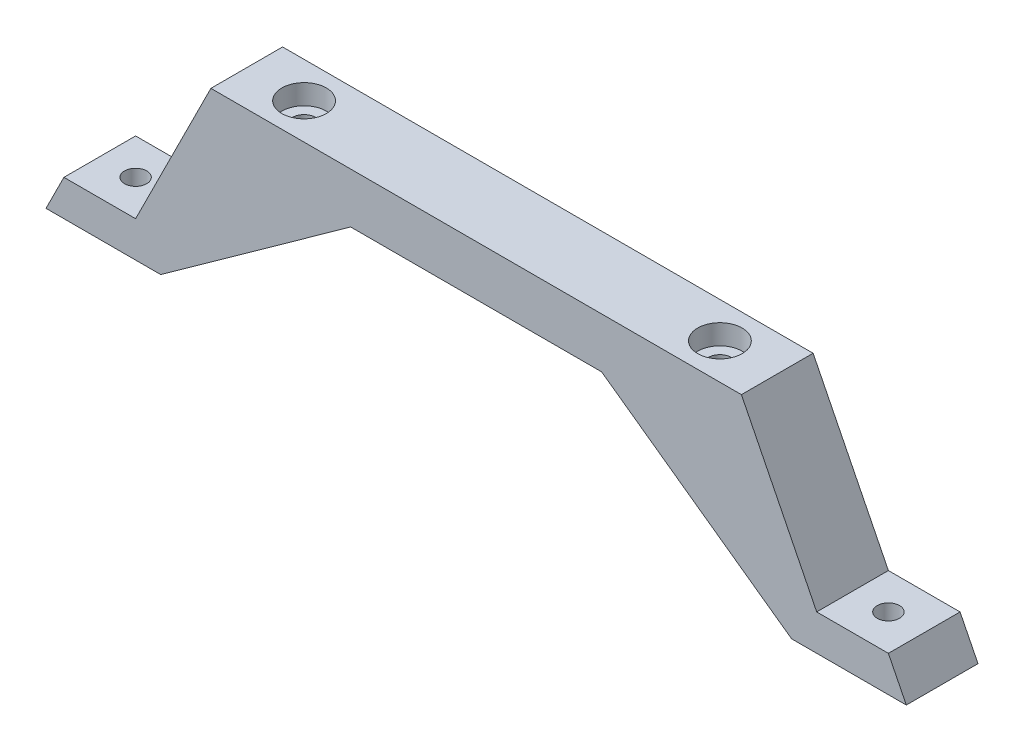
ISO-10303-21;
HEADER;
FILE_DESCRIPTION(('STEP AP214'),'2;1');
FILE_NAME('part.step','',(''),(''),'','','');
FILE_SCHEMA(('AUTOMOTIVE_DESIGN { 1 0 10303 214 1 1 1 1 }'));
ENDSEC;
DATA;
#1=APPLICATION_CONTEXT('core data for automotive mechanical design processes');
#2=APPLICATION_PROTOCOL_DEFINITION('international standard','automotive_design',2000,#1);
#3=PRODUCT_CONTEXT('',#1,'mechanical');
#4=PRODUCT('Part','Part','',(#3));
#5=PRODUCT_RELATED_PRODUCT_CATEGORY('part','',(#4));
#6=PRODUCT_DEFINITION_FORMATION('','',#4);
#7=PRODUCT_DEFINITION_CONTEXT('part definition',#1,'design');
#8=PRODUCT_DEFINITION('design','',#6,#7);
#9=PRODUCT_DEFINITION_SHAPE('','',#8);
#10=(LENGTH_UNIT() NAMED_UNIT(*) SI_UNIT(.MILLI.,.METRE.));
#11=(NAMED_UNIT(*) PLANE_ANGLE_UNIT() SI_UNIT($,.RADIAN.));
#12=(NAMED_UNIT(*) SI_UNIT($,.STERADIAN.) SOLID_ANGLE_UNIT());
#13=UNCERTAINTY_MEASURE_WITH_UNIT(LENGTH_MEASURE(1.E-05),#10,'distance_accuracy_value','');
#14=(GEOMETRIC_REPRESENTATION_CONTEXT(3) GLOBAL_UNCERTAINTY_ASSIGNED_CONTEXT((#13)) GLOBAL_UNIT_ASSIGNED_CONTEXT((#10,
#11,#12)) REPRESENTATION_CONTEXT('',''));
#15=CARTESIAN_POINT('',(0.,0.,0.));
#16=DIRECTION('',(0.,0.,1.));
#17=DIRECTION('',(1.,0.,0.));
#18=AXIS2_PLACEMENT_3D('',#15,#16,#17);
#19=CARTESIAN_POINT('',(62.8112870760149,-12.9471515277979,5.));
#20=DIRECTION('',(0.,1.,0.));
#21=DIRECTION('',(0.,0.,1.));
#22=AXIS2_PLACEMENT_3D('',#19,#20,#21);
#23=CYLINDRICAL_SURFACE('',#22,1.60000000000001);
#24=CARTESIAN_POINT('',(62.8112870760149,-2.19243454666585,5.));
#25=DIRECTION('',(-0.582687773294949,-0.812696104858744,0.));
#26=DIRECTION('',(-0.812696104858744,0.582687773294949,0.));
#27=AXIS2_PLACEMENT_3D('',#24,#25,#26);
#28=ELLIPSE('',#27,1.96875559072367,1.60000000000001);
#29=CARTESIAN_POINT('',(61.2112870760149,-1.0452647353451,5.));
#30=VERTEX_POINT('',#29);
#31=EDGE_CURVE('E150',#30,#30,#28,.T.);
#32=ORIENTED_EDGE('',*,*,#31,.T.);
#33=EDGE_LOOP('',(#32));
#34=FACE_BOUND('',#33,.T.);
#35=CARTESIAN_POINT('',(62.8112870760149,10.2528484722021,5.));
#36=DIRECTION('',(0.,1.,0.));
#37=DIRECTION('',(0.,0.,1.));
#38=AXIS2_PLACEMENT_3D('',#35,#36,#37);
#39=CIRCLE('',#38,1.60000000000001);
#40=CARTESIAN_POINT('',(62.8112870760149,10.2528484722021,6.6));
#41=VERTEX_POINT('',#40);
#42=EDGE_CURVE('E38',#41,#41,#39,.F.);
#43=ORIENTED_EDGE('',*,*,#42,.F.);
#44=EDGE_LOOP('',(#43));
#45=FACE_BOUND('',#44,.T.);
#46=ADVANCED_FACE('F34',(#34,#45),#23,.F.);
#47=CARTESIAN_POINT('',(4.8112870760149,-12.9471515277979,5.));
#48=DIRECTION('',(0.,1.,0.));
#49=DIRECTION('',(0.,0.,1.));
#50=AXIS2_PLACEMENT_3D('',#47,#48,#49);
#51=CYLINDRICAL_SURFACE('',#50,1.6);
#52=CARTESIAN_POINT('',(4.8112870760149,-2.19243454666585,5.));
#53=DIRECTION('',(-0.582687773294949,0.812696104858744,0.));
#54=DIRECTION('',(0.812696104858744,0.582687773294949,0.));
#55=AXIS2_PLACEMENT_3D('',#52,#53,#54);
#56=ELLIPSE('',#55,1.96875559072367,1.6);
#57=CARTESIAN_POINT('',(6.4112870760149,-1.0452647353451,5.));
#58=VERTEX_POINT('',#57);
#59=EDGE_CURVE('E152',#58,#58,#56,.T.);
#60=ORIENTED_EDGE('',*,*,#59,.F.);
#61=EDGE_LOOP('',(#60));
#62=FACE_BOUND('',#61,.T.);
#63=CARTESIAN_POINT('',(4.8112870760149,10.2528484722021,5.));
#64=DIRECTION('',(0.,1.,0.));
#65=DIRECTION('',(0.,0.,1.));
#66=AXIS2_PLACEMENT_3D('',#63,#64,#65);
#67=CIRCLE('',#66,1.6);
#68=CARTESIAN_POINT('',(4.8112870760149,10.2528484722021,6.6));
#69=VERTEX_POINT('',#68);
#70=EDGE_CURVE('E153',#69,#69,#67,.F.);
#71=ORIENTED_EDGE('',*,*,#70,.F.);
#72=EDGE_LOOP('',(#71));
#73=FACE_BOUND('',#72,.T.);
#74=ADVANCED_FACE('F287',(#62,#73),#51,.F.);
#75=CARTESIAN_POINT('',(-23.6887129239851,-7.94715152779793,10.));
#76=DIRECTION('',(0.894427190999916,-0.447213595499958,0.));
#77=DIRECTION('',(0.447213595499958,0.894427190999916,0.));
#78=AXIS2_PLACEMENT_3D('',#75,#76,#77);
#79=PLANE('',#78);
#80=DIRECTION('',(-0.447213595499958,-0.894427190999916,0.));
#81=VECTOR('',#80,1.);
#82=CARTESIAN_POINT('',(-23.6887129239851,-7.94715152779793,0.));
#83=LINE('',#82,#81);
#84=CARTESIAN_POINT('',(-23.6887129239851,-7.94715152779793,0.));
#85=VERTEX_POINT('',#84);
#86=CARTESIAN_POINT('',(-26.1887129239851,-12.9471515277979,0.));
#87=VERTEX_POINT('',#86);
#88=EDGE_CURVE('E129',#85,#87,#83,.T.);
#89=ORIENTED_EDGE('',*,*,#88,.T.);
#90=DIRECTION('',(0.,0.,-1.));
#91=VECTOR('',#90,1.);
#92=CARTESIAN_POINT('',(-26.1887129239851,-12.9471515277979,10.));
#93=LINE('',#92,#91);
#94=CARTESIAN_POINT('',(-26.1887129239851,-12.9471515277979,10.));
#95=VERTEX_POINT('',#94);
#96=EDGE_CURVE('E11',#95,#87,#93,.T.);
#97=ORIENTED_EDGE('',*,*,#96,.F.);
#98=DIRECTION('',(-0.447213595499958,-0.894427190999916,0.));
#99=VECTOR('',#98,1.);
#100=CARTESIAN_POINT('',(-23.6887129239851,-7.94715152779793,10.));
#101=LINE('',#100,#99);
#102=CARTESIAN_POINT('',(-23.6887129239851,-7.94715152779793,10.));
#103=VERTEX_POINT('',#102);
#104=EDGE_CURVE('E143',#103,#95,#101,.T.);
#105=ORIENTED_EDGE('',*,*,#104,.F.);
#106=DIRECTION('',(0.,0.,-1.));
#107=VECTOR('',#106,1.);
#108=CARTESIAN_POINT('',(-23.6887129239851,-7.94715152779793,10.));
#109=LINE('',#108,#107);
#110=EDGE_CURVE('E125',#103,#85,#109,.T.);
#111=ORIENTED_EDGE('',*,*,#110,.T.);
#112=EDGE_LOOP('',(#89,#97,#105,#111));
#113=FACE_BOUND('',#112,.T.);
#114=ADVANCED_FACE('F36',(#113),#79,.F.);
#115=CARTESIAN_POINT('',(-26.1887129239851,-12.9471515277979,10.));
#116=DIRECTION('',(0.,1.,0.));
#117=DIRECTION('',(0.,0.,1.));
#118=AXIS2_PLACEMENT_3D('',#115,#116,#117);
#119=PLANE('',#118);
#120=CARTESIAN_POINT('',(-18.6887129239851,-12.9471515277979,5.));
#121=DIRECTION('',(0.,1.,0.));
#122=DIRECTION('',(0.,0.,1.));
#123=AXIS2_PLACEMENT_3D('',#120,#121,#122);
#124=CIRCLE('',#123,1.55);
#125=CARTESIAN_POINT('',(-18.6887129239851,-12.9471515277979,6.55));
#126=VERTEX_POINT('',#125);
#127=EDGE_CURVE('E490',#126,#126,#124,.T.);
#128=ORIENTED_EDGE('',*,*,#127,.T.);
#129=EDGE_LOOP('',(#128));
#130=FACE_BOUND('',#129,.T.);
#131=DIRECTION('',(1.,0.,0.));
#132=VECTOR('',#131,1.);
#133=CARTESIAN_POINT('',(-26.1887129239851,-12.9471515277979,0.));
#134=LINE('',#133,#132);
#135=CARTESIAN_POINT('',(-10.1887129239851,-12.9471515277979,0.));
#136=VERTEX_POINT('',#135);
#137=EDGE_CURVE('E132',#87,#136,#134,.T.);
#138=ORIENTED_EDGE('',*,*,#137,.T.);
#139=DIRECTION('',(0.,0.,-1.));
#140=VECTOR('',#139,1.);
#141=CARTESIAN_POINT('',(-10.1887129239851,-12.9471515277979,10.));
#142=LINE('',#141,#140);
#143=CARTESIAN_POINT('',(-10.1887129239851,-12.9471515277979,10.));
#144=VERTEX_POINT('',#143);
#145=EDGE_CURVE('E44',#144,#136,#142,.T.);
#146=ORIENTED_EDGE('',*,*,#145,.F.);
#147=DIRECTION('',(1.,0.,0.));
#148=VECTOR('',#147,1.);
#149=CARTESIAN_POINT('',(-26.1887129239851,-12.9471515277979,10.));
#150=LINE('',#149,#148);
#151=EDGE_CURVE('E91',#95,#144,#150,.T.);
#152=ORIENTED_EDGE('',*,*,#151,.F.);
#153=ORIENTED_EDGE('',*,*,#96,.T.);
#154=EDGE_LOOP('',(#138,#146,#152,#153));
#155=FACE_BOUND('',#154,.T.);
#156=ADVANCED_FACE('F464',(#130,#155),#119,.F.);
#157=CARTESIAN_POINT('',(-10.1887129239851,-12.9471515277979,10.));
#158=DIRECTION('',(-0.582687773294949,0.812696104858744,0.));
#159=DIRECTION('',(-0.812696104858744,-0.582687773294949,0.));
#160=AXIS2_PLACEMENT_3D('',#157,#158,#159);
#161=PLANE('',#160);
#162=ORIENTED_EDGE('',*,*,#59,.T.);
#163=EDGE_LOOP('',(#162));
#164=FACE_BOUND('',#163,.T.);
#165=DIRECTION('',(0.812696104858744,0.582687773294949,0.));
#166=VECTOR('',#165,1.);
#167=CARTESIAN_POINT('',(-10.1887129239851,-12.9471515277979,0.));
#168=LINE('',#167,#166);
#169=CARTESIAN_POINT('',(16.3112870760149,6.05284847220206,0.));
#170=VERTEX_POINT('',#169);
#171=EDGE_CURVE('E135',#136,#170,#168,.T.);
#172=ORIENTED_EDGE('',*,*,#171,.T.);
#173=DIRECTION('',(0.,0.,-1.));
#174=VECTOR('',#173,1.);
#175=CARTESIAN_POINT('',(16.3112870760149,6.05284847220206,10.));
#176=LINE('',#175,#174);
#177=CARTESIAN_POINT('',(16.3112870760149,6.05284847220206,10.));
#178=VERTEX_POINT('',#177);
#179=EDGE_CURVE('E120',#178,#170,#176,.T.);
#180=ORIENTED_EDGE('',*,*,#179,.F.);
#181=DIRECTION('',(0.812696104858744,0.582687773294949,0.));
#182=VECTOR('',#181,1.);
#183=CARTESIAN_POINT('',(-10.1887129239851,-12.9471515277979,10.));
#184=LINE('',#183,#182);
#185=EDGE_CURVE('E217',#144,#178,#184,.T.);
#186=ORIENTED_EDGE('',*,*,#185,.F.);
#187=ORIENTED_EDGE('',*,*,#145,.T.);
#188=EDGE_LOOP('',(#172,#180,#186,#187));
#189=FACE_BOUND('',#188,.T.);
#190=ADVANCED_FACE('F447',(#164,#189),#161,.F.);
#191=CARTESIAN_POINT('',(16.3112870760149,6.05284847220206,10.));
#192=DIRECTION('',(0.,1.,0.));
#193=DIRECTION('',(-1.,0.,0.));
#194=AXIS2_PLACEMENT_3D('',#191,#192,#193);
#195=PLANE('',#194);
#196=DIRECTION('',(1.,0.,0.));
#197=VECTOR('',#196,1.);
#198=CARTESIAN_POINT('',(16.3112870760149,6.05284847220206,0.));
#199=LINE('',#198,#197);
#200=CARTESIAN_POINT('',(51.3112870760149,6.05284847220206,0.));
#201=VERTEX_POINT('',#200);
#202=EDGE_CURVE('E137',#170,#201,#199,.T.);
#203=ORIENTED_EDGE('',*,*,#202,.T.);
#204=DIRECTION('',(0.,0.,-1.));
#205=VECTOR('',#204,1.);
#206=CARTESIAN_POINT('',(51.3112870760149,6.05284847220206,10.));
#207=LINE('',#206,#205);
#208=CARTESIAN_POINT('',(51.3112870760149,6.05284847220206,10.));
#209=VERTEX_POINT('',#208);
#210=EDGE_CURVE('E205',#209,#201,#207,.T.);
#211=ORIENTED_EDGE('',*,*,#210,.F.);
#212=DIRECTION('',(1.,0.,0.));
#213=VECTOR('',#212,1.);
#214=CARTESIAN_POINT('',(16.3112870760149,6.05284847220206,10.));
#215=LINE('',#214,#213);
#216=EDGE_CURVE('E114',#178,#209,#215,.T.);
#217=ORIENTED_EDGE('',*,*,#216,.F.);
#218=ORIENTED_EDGE('',*,*,#179,.T.);
#219=EDGE_LOOP('',(#203,#211,#217,#218));
#220=FACE_BOUND('',#219,.T.);
#221=ADVANCED_FACE('F229',(#220),#195,.F.);
#222=CARTESIAN_POINT('',(-3.1887129239851,13.0528484722021,10.));
#223=DIRECTION('',(0.,-1.,0.));
#224=DIRECTION('',(0.,0.,-1.));
#225=AXIS2_PLACEMENT_3D('',#222,#223,#224);
#226=PLANE('',#225);
#227=CARTESIAN_POINT('',(62.8112870760149,13.0528484722021,5.));
#228=DIRECTION('',(0.,1.,0.));
#229=DIRECTION('',(0.,0.,1.));
#230=AXIS2_PLACEMENT_3D('',#227,#228,#229);
#231=CIRCLE('',#230,3.1);
#232=CARTESIAN_POINT('',(62.8112870760149,13.0528484722021,8.1));
#233=VERTEX_POINT('',#232);
#234=EDGE_CURVE('E166',#233,#233,#231,.T.);
#235=ORIENTED_EDGE('',*,*,#234,.F.);
#236=EDGE_LOOP('',(#235));
#237=FACE_BOUND('',#236,.T.);
#238=CARTESIAN_POINT('',(4.8112870760149,13.0528484722021,5.));
#239=DIRECTION('',(0.,1.,0.));
#240=DIRECTION('',(0.,0.,1.));
#241=AXIS2_PLACEMENT_3D('',#238,#239,#240);
#242=CIRCLE('',#241,3.1);
#243=CARTESIAN_POINT('',(4.8112870760149,13.0528484722021,8.1));
#244=VERTEX_POINT('',#243);
#245=EDGE_CURVE('E159',#244,#244,#242,.T.);
#246=ORIENTED_EDGE('',*,*,#245,.F.);
#247=EDGE_LOOP('',(#246));
#248=FACE_BOUND('',#247,.T.);
#249=DIRECTION('',(-1.,0.,0.));
#250=VECTOR('',#249,1.);
#251=CARTESIAN_POINT('',(-3.1887129239851,13.0528484722021,0.));
#252=LINE('',#251,#250);
#253=CARTESIAN_POINT('',(70.8112870760149,13.0528484722021,0.));
#254=VERTEX_POINT('',#253);
#255=CARTESIAN_POINT('',(-3.1887129239851,13.0528484722021,0.));
#256=VERTEX_POINT('',#255);
#257=EDGE_CURVE('E119',#254,#256,#252,.T.);
#258=ORIENTED_EDGE('',*,*,#257,.T.);
#259=DIRECTION('',(0.,0.,-1.));
#260=VECTOR('',#259,1.);
#261=CARTESIAN_POINT('',(-3.1887129239851,13.0528484722021,10.));
#262=LINE('',#261,#260);
#263=CARTESIAN_POINT('',(-3.1887129239851,13.0528484722021,10.));
#264=VERTEX_POINT('',#263);
#265=EDGE_CURVE('E116',#264,#256,#262,.T.);
#266=ORIENTED_EDGE('',*,*,#265,.F.);
#267=DIRECTION('',(-1.,0.,0.));
#268=VECTOR('',#267,1.);
#269=CARTESIAN_POINT('',(-3.1887129239851,13.0528484722021,10.));
#270=LINE('',#269,#268);
#271=CARTESIAN_POINT('',(70.8112870760149,13.0528484722021,10.));
#272=VERTEX_POINT('',#271);
#273=EDGE_CURVE('E102',#272,#264,#270,.T.);
#274=ORIENTED_EDGE('',*,*,#273,.F.);
#275=DIRECTION('',(0.,0.,-1.));
#276=VECTOR('',#275,1.);
#277=CARTESIAN_POINT('',(70.8112870760149,13.0528484722021,10.));
#278=LINE('',#277,#276);
#279=EDGE_CURVE('E208',#272,#254,#278,.T.);
#280=ORIENTED_EDGE('',*,*,#279,.T.);
#281=EDGE_LOOP('',(#258,#266,#274,#280));
#282=FACE_BOUND('',#281,.T.);
#283=ADVANCED_FACE('F117',(#237,#248,#282),#226,.F.);
#284=CARTESIAN_POINT('',(-13.6887129239851,-7.94715152779793,10.));
#285=DIRECTION('',(0.894427190999916,-0.447213595499958,0.));
#286=DIRECTION('',(0.447213595499958,0.894427190999916,0.));
#287=AXIS2_PLACEMENT_3D('',#284,#285,#286);
#288=PLANE('',#287);
#289=DIRECTION('',(-0.447213595499958,-0.894427190999916,0.));
#290=VECTOR('',#289,1.);
#291=CARTESIAN_POINT('',(-13.6887129239851,-7.94715152779793,0.));
#292=LINE('',#291,#290);
#293=CARTESIAN_POINT('',(-13.6887129239851,-7.94715152779793,0.));
#294=VERTEX_POINT('',#293);
#295=EDGE_CURVE('E77',#256,#294,#292,.T.);
#296=ORIENTED_EDGE('',*,*,#295,.T.);
#297=DIRECTION('',(0.,0.,-1.));
#298=VECTOR('',#297,1.);
#299=CARTESIAN_POINT('',(-13.6887129239851,-7.94715152779793,10.));
#300=LINE('',#299,#298);
#301=CARTESIAN_POINT('',(-13.6887129239851,-7.94715152779793,10.));
#302=VERTEX_POINT('',#301);
#303=EDGE_CURVE('E121',#302,#294,#300,.T.);
#304=ORIENTED_EDGE('',*,*,#303,.F.);
#305=DIRECTION('',(-0.447213595499958,-0.894427190999916,0.));
#306=VECTOR('',#305,1.);
#307=CARTESIAN_POINT('',(-13.6887129239851,-7.94715152779793,10.));
#308=LINE('',#307,#306);
#309=EDGE_CURVE('E106',#264,#302,#308,.T.);
#310=ORIENTED_EDGE('',*,*,#309,.F.);
#311=ORIENTED_EDGE('',*,*,#265,.T.);
#312=EDGE_LOOP('',(#296,#304,#310,#311));
#313=FACE_BOUND('',#312,.T.);
#314=ADVANCED_FACE('F123',(#313),#288,.F.);
#315=CARTESIAN_POINT('',(-13.6887129239851,-7.94715152779793,10.));
#316=DIRECTION('',(0.,-1.,0.));
#317=DIRECTION('',(0.,0.,-1.));
#318=AXIS2_PLACEMENT_3D('',#315,#316,#317);
#319=PLANE('',#318);
#320=CARTESIAN_POINT('',(-18.6887129239851,-7.94715152779793,5.));
#321=DIRECTION('',(0.,1.,0.));
#322=DIRECTION('',(0.,0.,1.));
#323=AXIS2_PLACEMENT_3D('',#320,#321,#322);
#324=CIRCLE('',#323,1.55);
#325=CARTESIAN_POINT('',(-18.6887129239851,-7.94715152779793,6.55));
#326=VERTEX_POINT('',#325);
#327=EDGE_CURVE('E491',#326,#326,#324,.T.);
#328=ORIENTED_EDGE('',*,*,#327,.F.);
#329=EDGE_LOOP('',(#328));
#330=FACE_BOUND('',#329,.T.);
#331=DIRECTION('',(-1.,0.,0.));
#332=VECTOR('',#331,1.);
#333=CARTESIAN_POINT('',(-13.6887129239851,-7.94715152779793,0.));
#334=LINE('',#333,#332);
#335=EDGE_CURVE('E83',#294,#85,#334,.T.);
#336=ORIENTED_EDGE('',*,*,#335,.T.);
#337=ORIENTED_EDGE('',*,*,#110,.F.);
#338=DIRECTION('',(-1.,0.,0.));
#339=VECTOR('',#338,1.);
#340=CARTESIAN_POINT('',(-13.6887129239851,-7.94715152779793,10.));
#341=LINE('',#340,#339);
#342=EDGE_CURVE('E53',#302,#103,#341,.T.);
#343=ORIENTED_EDGE('',*,*,#342,.F.);
#344=ORIENTED_EDGE('',*,*,#303,.T.);
#345=EDGE_LOOP('',(#336,#337,#343,#344));
#346=FACE_BOUND('',#345,.T.);
#347=ADVANCED_FACE('F274',(#330,#346),#319,.F.);
#348=CARTESIAN_POINT('',(0.,0.,10.));
#349=DIRECTION('',(0.,0.,1.));
#350=DIRECTION('',(1.,0.,0.));
#351=AXIS2_PLACEMENT_3D('',#348,#349,#350);
#352=PLANE('',#351);
#353=ORIENTED_EDGE('',*,*,#104,.T.);
#354=ORIENTED_EDGE('',*,*,#151,.T.);
#355=ORIENTED_EDGE('',*,*,#185,.T.);
#356=ORIENTED_EDGE('',*,*,#216,.T.);
#357=DIRECTION('',(-0.812696104858744,0.582687773294949,0.));
#358=VECTOR('',#357,1.);
#359=CARTESIAN_POINT('',(77.8112870760149,-12.9471515277979,10.));
#360=LINE('',#359,#358);
#361=CARTESIAN_POINT('',(77.8112870760149,-12.9471515277979,10.));
#362=VERTEX_POINT('',#361);
#363=EDGE_CURVE('E180',#362,#209,#360,.T.);
#364=ORIENTED_EDGE('',*,*,#363,.F.);
#365=DIRECTION('',(-1.,0.,0.));
#366=VECTOR('',#365,1.);
#367=CARTESIAN_POINT('',(93.8112870760149,-12.9471515277979,10.));
#368=LINE('',#367,#366);
#369=CARTESIAN_POINT('',(93.8112870760149,-12.9471515277979,10.));
#370=VERTEX_POINT('',#369);
#371=EDGE_CURVE('E183',#370,#362,#368,.T.);
#372=ORIENTED_EDGE('',*,*,#371,.F.);
#373=DIRECTION('',(0.447213595499958,-0.894427190999916,0.));
#374=VECTOR('',#373,1.);
#375=CARTESIAN_POINT('',(91.3112870760149,-7.94715152779793,10.));
#376=LINE('',#375,#374);
#377=CARTESIAN_POINT('',(91.3112870760149,-7.94715152779793,10.));
#378=VERTEX_POINT('',#377);
#379=EDGE_CURVE('E172',#378,#370,#376,.T.);
#380=ORIENTED_EDGE('',*,*,#379,.F.);
#381=DIRECTION('',(1.,0.,0.));
#382=VECTOR('',#381,1.);
#383=CARTESIAN_POINT('',(81.3112870760149,-7.94715152779793,10.));
#384=LINE('',#383,#382);
#385=CARTESIAN_POINT('',(81.3112870760149,-7.94715152779793,10.));
#386=VERTEX_POINT('',#385);
#387=EDGE_CURVE('E175',#386,#378,#384,.T.);
#388=ORIENTED_EDGE('',*,*,#387,.F.);
#389=DIRECTION('',(0.447213595499958,-0.894427190999916,0.));
#390=VECTOR('',#389,1.);
#391=CARTESIAN_POINT('',(81.3112870760149,-7.94715152779793,10.));
#392=LINE('',#391,#390);
#393=EDGE_CURVE('E110',#272,#386,#392,.T.);
#394=ORIENTED_EDGE('',*,*,#393,.F.);
#395=ORIENTED_EDGE('',*,*,#273,.T.);
#396=ORIENTED_EDGE('',*,*,#309,.T.);
#397=ORIENTED_EDGE('',*,*,#342,.T.);
#398=EDGE_LOOP('',(#353,#354,#355,#356,#364,#372,#380,#388,#394,#395,#396,#397));
#399=FACE_BOUND('',#398,.T.);
#400=ADVANCED_FACE('F104',(#399),#352,.T.);
#401=CARTESIAN_POINT('',(0.,0.,0.));
#402=DIRECTION('',(0.,0.,1.));
#403=DIRECTION('',(1.,0.,0.));
#404=AXIS2_PLACEMENT_3D('',#401,#402,#403);
#405=PLANE('',#404);
#406=ORIENTED_EDGE('',*,*,#88,.F.);
#407=ORIENTED_EDGE('',*,*,#335,.F.);
#408=ORIENTED_EDGE('',*,*,#295,.F.);
#409=ORIENTED_EDGE('',*,*,#257,.F.);
#410=DIRECTION('',(0.447213595499958,-0.894427190999916,0.));
#411=VECTOR('',#410,1.);
#412=CARTESIAN_POINT('',(81.3112870760149,-7.94715152779793,0.));
#413=LINE('',#412,#411);
#414=CARTESIAN_POINT('',(81.3112870760149,-7.94715152779793,0.));
#415=VERTEX_POINT('',#414);
#416=EDGE_CURVE('E192',#254,#415,#413,.T.);
#417=ORIENTED_EDGE('',*,*,#416,.T.);
#418=DIRECTION('',(1.,0.,0.));
#419=VECTOR('',#418,1.);
#420=CARTESIAN_POINT('',(81.3112870760149,-7.94715152779793,0.));
#421=LINE('',#420,#419);
#422=CARTESIAN_POINT('',(91.3112870760149,-7.94715152779793,0.));
#423=VERTEX_POINT('',#422);
#424=EDGE_CURVE('E189',#415,#423,#421,.T.);
#425=ORIENTED_EDGE('',*,*,#424,.T.);
#426=DIRECTION('',(0.447213595499958,-0.894427190999916,0.));
#427=VECTOR('',#426,1.);
#428=CARTESIAN_POINT('',(91.3112870760149,-7.94715152779793,0.));
#429=LINE('',#428,#427);
#430=CARTESIAN_POINT('',(93.8112870760149,-12.9471515277979,0.));
#431=VERTEX_POINT('',#430);
#432=EDGE_CURVE('E171',#423,#431,#429,.T.);
#433=ORIENTED_EDGE('',*,*,#432,.T.);
#434=DIRECTION('',(-1.,0.,0.));
#435=VECTOR('',#434,1.);
#436=CARTESIAN_POINT('',(93.8112870760149,-12.9471515277979,0.));
#437=LINE('',#436,#435);
#438=CARTESIAN_POINT('',(77.8112870760149,-12.9471515277979,0.));
#439=VERTEX_POINT('',#438);
#440=EDGE_CURVE('E176',#431,#439,#437,.T.);
#441=ORIENTED_EDGE('',*,*,#440,.T.);
#442=DIRECTION('',(-0.812696104858744,0.582687773294949,0.));
#443=VECTOR('',#442,1.);
#444=CARTESIAN_POINT('',(77.8112870760149,-12.9471515277979,0.));
#445=LINE('',#444,#443);
#446=EDGE_CURVE('E195',#439,#201,#445,.T.);
#447=ORIENTED_EDGE('',*,*,#446,.T.);
#448=ORIENTED_EDGE('',*,*,#202,.F.);
#449=ORIENTED_EDGE('',*,*,#171,.F.);
#450=ORIENTED_EDGE('',*,*,#137,.F.);
#451=EDGE_LOOP('',(#406,#407,#408,#409,#417,#425,#433,#441,#447,#448,#449,#450));
#452=FACE_BOUND('',#451,.T.);
#453=ADVANCED_FACE('F269',(#452),#405,.F.);
#454=CARTESIAN_POINT('',(91.3112870760149,-7.94715152779793,10.));
#455=DIRECTION('',(0.894427190999916,0.447213595499958,0.));
#456=DIRECTION('',(-0.447213595499958,0.894427190999916,0.));
#457=AXIS2_PLACEMENT_3D('',#454,#455,#456);
#458=PLANE('',#457);
#459=ORIENTED_EDGE('',*,*,#432,.F.);
#460=DIRECTION('',(0.,0.,-1.));
#461=VECTOR('',#460,1.);
#462=CARTESIAN_POINT('',(91.3112870760149,-7.94715152779793,10.));
#463=LINE('',#462,#461);
#464=EDGE_CURVE('E133',#378,#423,#463,.T.);
#465=ORIENTED_EDGE('',*,*,#464,.F.);
#466=ORIENTED_EDGE('',*,*,#379,.T.);
#467=DIRECTION('',(0.,0.,-1.));
#468=VECTOR('',#467,1.);
#469=CARTESIAN_POINT('',(93.8112870760149,-12.9471515277979,10.));
#470=LINE('',#469,#468);
#471=EDGE_CURVE('E186',#370,#431,#470,.T.);
#472=ORIENTED_EDGE('',*,*,#471,.T.);
#473=EDGE_LOOP('',(#459,#465,#466,#472));
#474=FACE_BOUND('',#473,.T.);
#475=ADVANCED_FACE('F260',(#474),#458,.T.);
#476=CARTESIAN_POINT('',(81.3112870760149,-7.94715152779793,10.));
#477=DIRECTION('',(0.,1.,0.));
#478=DIRECTION('',(0.,0.,1.));
#479=AXIS2_PLACEMENT_3D('',#476,#477,#478);
#480=PLANE('',#479);
#481=CARTESIAN_POINT('',(86.3112870760149,-7.94715152779793,4.99999999999999));
#482=DIRECTION('',(0.,1.,0.));
#483=DIRECTION('',(0.,0.,1.));
#484=AXIS2_PLACEMENT_3D('',#481,#482,#483);
#485=CIRCLE('',#484,1.54999999999999);
#486=CARTESIAN_POINT('',(86.3112870760149,-7.94715152779793,6.54999999999999));
#487=VERTEX_POINT('',#486);
#488=EDGE_CURVE('E499',#487,#487,#485,.T.);
#489=ORIENTED_EDGE('',*,*,#488,.F.);
#490=EDGE_LOOP('',(#489));
#491=FACE_BOUND('',#490,.T.);
#492=ORIENTED_EDGE('',*,*,#424,.F.);
#493=DIRECTION('',(0.,0.,-1.));
#494=VECTOR('',#493,1.);
#495=CARTESIAN_POINT('',(81.3112870760149,-7.94715152779793,10.));
#496=LINE('',#495,#494);
#497=EDGE_CURVE('E210',#386,#415,#496,.T.);
#498=ORIENTED_EDGE('',*,*,#497,.F.);
#499=ORIENTED_EDGE('',*,*,#387,.T.);
#500=ORIENTED_EDGE('',*,*,#464,.T.);
#501=EDGE_LOOP('',(#492,#498,#499,#500));
#502=FACE_BOUND('',#501,.T.);
#503=ADVANCED_FACE('F263',(#491,#502),#480,.T.);
#504=CARTESIAN_POINT('',(81.3112870760149,-7.94715152779793,10.));
#505=DIRECTION('',(0.894427190999916,0.447213595499958,0.));
#506=DIRECTION('',(-0.447213595499958,0.894427190999916,0.));
#507=AXIS2_PLACEMENT_3D('',#504,#505,#506);
#508=PLANE('',#507);
#509=ORIENTED_EDGE('',*,*,#416,.F.);
#510=ORIENTED_EDGE('',*,*,#279,.F.);
#511=ORIENTED_EDGE('',*,*,#393,.T.);
#512=ORIENTED_EDGE('',*,*,#497,.T.);
#513=EDGE_LOOP('',(#509,#510,#511,#512));
#514=FACE_BOUND('',#513,.T.);
#515=ADVANCED_FACE('F266',(#514),#508,.T.);
#516=CARTESIAN_POINT('',(77.8112870760149,-12.9471515277979,10.));
#517=DIRECTION('',(-0.582687773294949,-0.812696104858744,0.));
#518=DIRECTION('',(0.812696104858744,-0.582687773294949,0.));
#519=AXIS2_PLACEMENT_3D('',#516,#517,#518);
#520=PLANE('',#519);
#521=ORIENTED_EDGE('',*,*,#31,.F.);
#522=EDGE_LOOP('',(#521));
#523=FACE_BOUND('',#522,.T.);
#524=ORIENTED_EDGE('',*,*,#446,.F.);
#525=DIRECTION('',(0.,0.,-1.));
#526=VECTOR('',#525,1.);
#527=CARTESIAN_POINT('',(77.8112870760149,-12.9471515277979,10.));
#528=LINE('',#527,#526);
#529=EDGE_CURVE('E202',#362,#439,#528,.T.);
#530=ORIENTED_EDGE('',*,*,#529,.F.);
#531=ORIENTED_EDGE('',*,*,#363,.T.);
#532=ORIENTED_EDGE('',*,*,#210,.T.);
#533=EDGE_LOOP('',(#524,#530,#531,#532));
#534=FACE_BOUND('',#533,.T.);
#535=ADVANCED_FACE('F235',(#523,#534),#520,.T.);
#536=CARTESIAN_POINT('',(93.8112870760149,-12.9471515277979,10.));
#537=DIRECTION('',(0.,-1.,0.));
#538=DIRECTION('',(0.,0.,-1.));
#539=AXIS2_PLACEMENT_3D('',#536,#537,#538);
#540=PLANE('',#539);
#541=CARTESIAN_POINT('',(86.3112870760149,-12.9471515277979,4.99999999999999));
#542=DIRECTION('',(0.,1.,0.));
#543=DIRECTION('',(0.,0.,1.));
#544=AXIS2_PLACEMENT_3D('',#541,#542,#543);
#545=CIRCLE('',#544,1.54999999999999);
#546=CARTESIAN_POINT('',(86.3112870760149,-12.9471515277979,6.54999999999999));
#547=VERTEX_POINT('',#546);
#548=EDGE_CURVE('E496',#547,#547,#545,.T.);
#549=ORIENTED_EDGE('',*,*,#548,.T.);
#550=EDGE_LOOP('',(#549));
#551=FACE_BOUND('',#550,.T.);
#552=ORIENTED_EDGE('',*,*,#440,.F.);
#553=ORIENTED_EDGE('',*,*,#471,.F.);
#554=ORIENTED_EDGE('',*,*,#371,.T.);
#555=ORIENTED_EDGE('',*,*,#529,.T.);
#556=EDGE_LOOP('',(#552,#553,#554,#555));
#557=FACE_BOUND('',#556,.T.);
#558=ADVANCED_FACE('F240',(#551,#557),#540,.T.);
#559=CARTESIAN_POINT('',(4.8112870760149,10.2528484722021,5.));
#560=DIRECTION('',(0.,1.,0.));
#561=DIRECTION('',(0.,0.,1.));
#562=AXIS2_PLACEMENT_3D('',#559,#560,#561);
#563=PLANE('',#562);
#564=CARTESIAN_POINT('',(4.8112870760149,10.2528484722021,5.));
#565=DIRECTION('',(0.,1.,0.));
#566=DIRECTION('',(0.,0.,1.));
#567=AXIS2_PLACEMENT_3D('',#564,#565,#566);
#568=CIRCLE('',#567,3.1);
#569=CARTESIAN_POINT('',(4.8112870760149,10.2528484722021,8.1));
#570=VERTEX_POINT('',#569);
#571=EDGE_CURVE('E155',#570,#570,#568,.T.);
#572=ORIENTED_EDGE('',*,*,#571,.T.);
#573=EDGE_LOOP('',(#572));
#574=FACE_BOUND('',#573,.T.);
#575=ORIENTED_EDGE('',*,*,#70,.T.);
#576=EDGE_LOOP('',(#575));
#577=FACE_BOUND('',#576,.T.);
#578=ADVANCED_FACE('F302',(#574,#577),#563,.T.);
#579=CARTESIAN_POINT('',(4.8112870760149,10.2528484722021,5.));
#580=DIRECTION('',(0.,1.,0.));
#581=DIRECTION('',(0.,0.,1.));
#582=AXIS2_PLACEMENT_3D('',#579,#580,#581);
#583=CYLINDRICAL_SURFACE('',#582,3.1);
#584=ORIENTED_EDGE('',*,*,#571,.F.);
#585=EDGE_LOOP('',(#584));
#586=FACE_BOUND('',#585,.T.);
#587=ORIENTED_EDGE('',*,*,#245,.T.);
#588=EDGE_LOOP('',(#587));
#589=FACE_BOUND('',#588,.T.);
#590=ADVANCED_FACE('F297',(#586,#589),#583,.F.);
#591=CARTESIAN_POINT('',(62.8112870760149,10.2528484722021,5.));
#592=DIRECTION('',(0.,1.,0.));
#593=DIRECTION('',(0.,0.,1.));
#594=AXIS2_PLACEMENT_3D('',#591,#592,#593);
#595=PLANE('',#594);
#596=CARTESIAN_POINT('',(62.8112870760149,10.2528484722021,5.));
#597=DIRECTION('',(0.,1.,0.));
#598=DIRECTION('',(0.,0.,1.));
#599=AXIS2_PLACEMENT_3D('',#596,#597,#598);
#600=CIRCLE('',#599,3.1);
#601=CARTESIAN_POINT('',(62.8112870760149,10.2528484722021,8.1));
#602=VERTEX_POINT('',#601);
#603=EDGE_CURVE('E494',#602,#602,#600,.T.);
#604=ORIENTED_EDGE('',*,*,#603,.T.);
#605=EDGE_LOOP('',(#604));
#606=FACE_BOUND('',#605,.T.);
#607=ORIENTED_EDGE('',*,*,#42,.T.);
#608=EDGE_LOOP('',(#607));
#609=FACE_BOUND('',#608,.T.);
#610=ADVANCED_FACE('F352',(#606,#609),#595,.T.);
#611=CARTESIAN_POINT('',(62.8112870760149,10.2528484722021,5.));
#612=DIRECTION('',(0.,1.,0.));
#613=DIRECTION('',(0.,0.,1.));
#614=AXIS2_PLACEMENT_3D('',#611,#612,#613);
#615=CYLINDRICAL_SURFACE('',#614,3.1);
#616=ORIENTED_EDGE('',*,*,#603,.F.);
#617=EDGE_LOOP('',(#616));
#618=FACE_BOUND('',#617,.T.);
#619=ORIENTED_EDGE('',*,*,#234,.T.);
#620=EDGE_LOOP('',(#619));
#621=FACE_BOUND('',#620,.T.);
#622=ADVANCED_FACE('F359',(#618,#621),#615,.F.);
#623=CARTESIAN_POINT('',(-18.6887129239851,-12.9471515277979,5.));
#624=DIRECTION('',(0.,1.,0.));
#625=DIRECTION('',(0.,0.,1.));
#626=AXIS2_PLACEMENT_3D('',#623,#624,#625);
#627=CYLINDRICAL_SURFACE('',#626,1.55);
#628=ORIENTED_EDGE('',*,*,#127,.F.);
#629=EDGE_LOOP('',(#628));
#630=FACE_BOUND('',#629,.T.);
#631=ORIENTED_EDGE('',*,*,#327,.T.);
#632=EDGE_LOOP('',(#631));
#633=FACE_BOUND('',#632,.T.);
#634=ADVANCED_FACE('F367',(#630,#633),#627,.F.);
#635=CARTESIAN_POINT('',(86.3112870760149,-12.9471515277979,4.99999999999999));
#636=DIRECTION('',(0.,1.,0.));
#637=DIRECTION('',(0.,0.,1.));
#638=AXIS2_PLACEMENT_3D('',#635,#636,#637);
#639=CYLINDRICAL_SURFACE('',#638,1.54999999999999);
#640=ORIENTED_EDGE('',*,*,#548,.F.);
#641=EDGE_LOOP('',(#640));
#642=FACE_BOUND('',#641,.T.);
#643=ORIENTED_EDGE('',*,*,#488,.T.);
#644=EDGE_LOOP('',(#643));
#645=FACE_BOUND('',#644,.T.);
#646=ADVANCED_FACE('F375',(#642,#645),#639,.F.);
#647=CLOSED_SHELL('',(#46,#74,#114,#156,#190,#221,#283,#314,#347,#400,#453,#475,#503,#515,#535,
#558,#578,#590,#610,#622,#634,#646));
#648=MANIFOLD_SOLID_BREP('B2',#647);
#649=ADVANCED_BREP_SHAPE_REPRESENTATION('',(#18,#648),#14);
#650=SHAPE_DEFINITION_REPRESENTATION(#9,#649);
ENDSEC;
END-ISO-10303-21;
